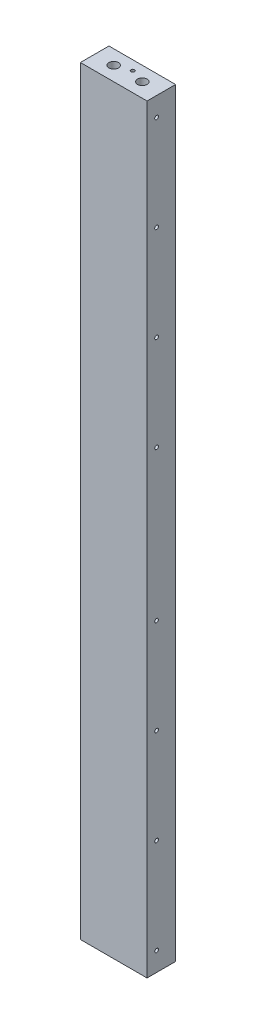
ISO-10303-21;
HEADER;
FILE_DESCRIPTION(('STEP AP214'),'2;1');
FILE_NAME('part.step','',(''),(''),'','','');
FILE_SCHEMA(('AUTOMOTIVE_DESIGN { 1 0 10303 214 1 1 1 1 }'));
ENDSEC;
DATA;
#1=APPLICATION_CONTEXT('core data for automotive mechanical design processes');
#2=APPLICATION_PROTOCOL_DEFINITION('international standard','automotive_design',2000,#1);
#3=PRODUCT_CONTEXT('',#1,'mechanical');
#4=PRODUCT('Part','Part','',(#3));
#5=PRODUCT_RELATED_PRODUCT_CATEGORY('part','',(#4));
#6=PRODUCT_DEFINITION_FORMATION('','',#4);
#7=PRODUCT_DEFINITION_CONTEXT('part definition',#1,'design');
#8=PRODUCT_DEFINITION('design','',#6,#7);
#9=PRODUCT_DEFINITION_SHAPE('','',#8);
#10=(LENGTH_UNIT() NAMED_UNIT(*) SI_UNIT(.MILLI.,.METRE.));
#11=(NAMED_UNIT(*) PLANE_ANGLE_UNIT() SI_UNIT($,.RADIAN.));
#12=(NAMED_UNIT(*) SI_UNIT($,.STERADIAN.) SOLID_ANGLE_UNIT());
#13=UNCERTAINTY_MEASURE_WITH_UNIT(LENGTH_MEASURE(1.E-05),#10,'distance_accuracy_value','');
#14=(GEOMETRIC_REPRESENTATION_CONTEXT(3) GLOBAL_UNCERTAINTY_ASSIGNED_CONTEXT((#13)) GLOBAL_UNIT_ASSIGNED_CONTEXT((#10,
#11,#12)) REPRESENTATION_CONTEXT('',''));
#15=CARTESIAN_POINT('',(0.,0.,0.));
#16=DIRECTION('',(0.,0.,1.));
#17=DIRECTION('',(1.,0.,0.));
#18=AXIS2_PLACEMENT_3D('',#15,#16,#17);
#19=CARTESIAN_POINT('',(0.,1012.825,0.));
#20=DIRECTION('',(1.,0.,0.));
#21=DIRECTION('',(0.,0.,-1.));
#22=AXIS2_PLACEMENT_3D('',#19,#20,#21);
#23=PLANE('',#22);
#24=DIRECTION('',(0.,0.,1.));
#25=VECTOR('',#24,1.);
#26=CARTESIAN_POINT('',(0.,0.,0.));
#27=LINE('',#26,#25);
#28=CARTESIAN_POINT('',(0.,0.,0.));
#29=VERTEX_POINT('',#28);
#30=CARTESIAN_POINT('',(0.,0.,38.1));
#31=VERTEX_POINT('',#30);
#32=EDGE_CURVE('E228',#29,#31,#27,.T.);
#33=ORIENTED_EDGE('',*,*,#32,.T.);
#34=DIRECTION('',(0.,-1.,0.));
#35=VECTOR('',#34,1.);
#36=CARTESIAN_POINT('',(0.,1012.825,38.1));
#37=LINE('',#36,#35);
#38=CARTESIAN_POINT('',(0.,1012.825,38.1));
#39=VERTEX_POINT('',#38);
#40=EDGE_CURVE('E12',#39,#31,#37,.T.);
#41=ORIENTED_EDGE('',*,*,#40,.F.);
#42=DIRECTION('',(0.,0.,1.));
#43=VECTOR('',#42,1.);
#44=CARTESIAN_POINT('',(0.,1012.825,0.));
#45=LINE('',#44,#43);
#46=CARTESIAN_POINT('',(0.,1012.825,0.));
#47=VERTEX_POINT('',#46);
#48=EDGE_CURVE('E239',#47,#39,#45,.T.);
#49=ORIENTED_EDGE('',*,*,#48,.F.);
#50=DIRECTION('',(0.,-1.,0.));
#51=VECTOR('',#50,1.);
#52=CARTESIAN_POINT('',(0.,1012.825,0.));
#53=LINE('',#52,#51);
#54=EDGE_CURVE('E245',#47,#29,#53,.T.);
#55=ORIENTED_EDGE('',*,*,#54,.T.);
#56=EDGE_LOOP('',(#33,#41,#49,#55));
#57=FACE_BOUND('',#56,.T.);
#58=ADVANCED_FACE('F56',(#57),#23,.F.);
#59=CARTESIAN_POINT('',(0.,1012.825,38.1));
#60=DIRECTION('',(0.,0.,-1.));
#61=DIRECTION('',(-1.,0.,0.));
#62=AXIS2_PLACEMENT_3D('',#59,#60,#61);
#63=PLANE('',#62);
#64=DIRECTION('',(1.,0.,0.));
#65=VECTOR('',#64,1.);
#66=CARTESIAN_POINT('',(0.,0.,38.1));
#67=LINE('',#66,#65);
#68=CARTESIAN_POINT('',(88.9,0.,38.1));
#69=VERTEX_POINT('',#68);
#70=EDGE_CURVE('E248',#31,#69,#67,.T.);
#71=ORIENTED_EDGE('',*,*,#70,.T.);
#72=DIRECTION('',(0.,-1.,0.));
#73=VECTOR('',#72,1.);
#74=CARTESIAN_POINT('',(88.9,1012.825,38.1));
#75=LINE('',#74,#73);
#76=CARTESIAN_POINT('',(88.9,1012.825,38.1));
#77=VERTEX_POINT('',#76);
#78=EDGE_CURVE('E64',#77,#69,#75,.T.);
#79=ORIENTED_EDGE('',*,*,#78,.F.);
#80=DIRECTION('',(1.,0.,0.));
#81=VECTOR('',#80,1.);
#82=CARTESIAN_POINT('',(0.,1012.825,38.1));
#83=LINE('',#82,#81);
#84=EDGE_CURVE('E103',#39,#77,#83,.T.);
#85=ORIENTED_EDGE('',*,*,#84,.F.);
#86=ORIENTED_EDGE('',*,*,#40,.T.);
#87=EDGE_LOOP('',(#71,#79,#85,#86));
#88=FACE_BOUND('',#87,.T.);
#89=ADVANCED_FACE('F274',(#88),#63,.F.);
#90=CARTESIAN_POINT('',(88.9,1012.825,0.));
#91=DIRECTION('',(-1.,0.,0.));
#92=DIRECTION('',(0.,0.,1.));
#93=AXIS2_PLACEMENT_3D('',#90,#91,#92);
#94=PLANE('',#93);
#95=CARTESIAN_POINT('',(88.9,987.425,25.4));
#96=DIRECTION('',(1.,0.,0.));
#97=DIRECTION('',(0.,0.,-1.));
#98=AXIS2_PLACEMENT_3D('',#95,#96,#97);
#99=CIRCLE('',#98,2.45744999999997);
#100=CARTESIAN_POINT('',(88.9,987.425,22.94255));
#101=VERTEX_POINT('',#100);
#102=EDGE_CURVE('E148',#101,#101,#99,.T.);
#103=ORIENTED_EDGE('',*,*,#102,.F.);
#104=EDGE_LOOP('',(#103));
#105=FACE_BOUND('',#104,.T.);
#106=CARTESIAN_POINT('',(88.9,860.425,25.4));
#107=DIRECTION('',(1.,0.,0.));
#108=DIRECTION('',(0.,0.,-1.));
#109=AXIS2_PLACEMENT_3D('',#106,#107,#108);
#110=CIRCLE('',#109,2.45744999999997);
#111=CARTESIAN_POINT('',(88.9,860.425,22.94255));
#112=VERTEX_POINT('',#111);
#113=EDGE_CURVE('E147',#112,#112,#110,.T.);
#114=ORIENTED_EDGE('',*,*,#113,.F.);
#115=EDGE_LOOP('',(#114));
#116=FACE_BOUND('',#115,.T.);
#117=CARTESIAN_POINT('',(88.9,733.425,25.4));
#118=DIRECTION('',(1.,0.,0.));
#119=DIRECTION('',(0.,0.,-1.));
#120=AXIS2_PLACEMENT_3D('',#117,#118,#119);
#121=CIRCLE('',#120,2.45744999999997);
#122=CARTESIAN_POINT('',(88.9,733.425,22.94255));
#123=VERTEX_POINT('',#122);
#124=EDGE_CURVE('E158',#123,#123,#121,.T.);
#125=ORIENTED_EDGE('',*,*,#124,.F.);
#126=EDGE_LOOP('',(#125));
#127=FACE_BOUND('',#126,.T.);
#128=CARTESIAN_POINT('',(88.9,606.425,25.4));
#129=DIRECTION('',(1.,0.,0.));
#130=DIRECTION('',(0.,0.,-1.));
#131=AXIS2_PLACEMENT_3D('',#128,#129,#130);
#132=CIRCLE('',#131,2.45744999999997);
#133=CARTESIAN_POINT('',(88.9,606.425,22.94255));
#134=VERTEX_POINT('',#133);
#135=EDGE_CURVE('E164',#134,#134,#132,.T.);
#136=ORIENTED_EDGE('',*,*,#135,.F.);
#137=EDGE_LOOP('',(#136));
#138=FACE_BOUND('',#137,.T.);
#139=CARTESIAN_POINT('',(88.9,406.4,25.4));
#140=DIRECTION('',(1.,0.,0.));
#141=DIRECTION('',(0.,0.,-1.));
#142=AXIS2_PLACEMENT_3D('',#139,#140,#141);
#143=CIRCLE('',#142,2.45744999999997);
#144=CARTESIAN_POINT('',(88.9,406.4,22.94255));
#145=VERTEX_POINT('',#144);
#146=EDGE_CURVE('E170',#145,#145,#143,.T.);
#147=ORIENTED_EDGE('',*,*,#146,.F.);
#148=EDGE_LOOP('',(#147));
#149=FACE_BOUND('',#148,.T.);
#150=CARTESIAN_POINT('',(88.9,279.4,25.4));
#151=DIRECTION('',(1.,0.,0.));
#152=DIRECTION('',(0.,0.,-1.));
#153=AXIS2_PLACEMENT_3D('',#150,#151,#152);
#154=CIRCLE('',#153,2.45744999999997);
#155=CARTESIAN_POINT('',(88.9,279.4,22.94255));
#156=VERTEX_POINT('',#155);
#157=EDGE_CURVE('E176',#156,#156,#154,.T.);
#158=ORIENTED_EDGE('',*,*,#157,.F.);
#159=EDGE_LOOP('',(#158));
#160=FACE_BOUND('',#159,.T.);
#161=CARTESIAN_POINT('',(88.9,152.4,25.4));
#162=DIRECTION('',(1.,0.,0.));
#163=DIRECTION('',(0.,0.,-1.));
#164=AXIS2_PLACEMENT_3D('',#161,#162,#163);
#165=CIRCLE('',#164,2.45745);
#166=CARTESIAN_POINT('',(88.9,152.4,22.94255));
#167=VERTEX_POINT('',#166);
#168=EDGE_CURVE('E182',#167,#167,#165,.T.);
#169=ORIENTED_EDGE('',*,*,#168,.F.);
#170=EDGE_LOOP('',(#169));
#171=FACE_BOUND('',#170,.T.);
#172=CARTESIAN_POINT('',(88.9,25.4,25.4));
#173=DIRECTION('',(1.,0.,0.));
#174=DIRECTION('',(0.,0.,-1.));
#175=AXIS2_PLACEMENT_3D('',#172,#173,#174);
#176=CIRCLE('',#175,2.45744999999999);
#177=CARTESIAN_POINT('',(88.9,25.4,22.94255));
#178=VERTEX_POINT('',#177);
#179=EDGE_CURVE('E188',#178,#178,#176,.T.);
#180=ORIENTED_EDGE('',*,*,#179,.F.);
#181=EDGE_LOOP('',(#180));
#182=FACE_BOUND('',#181,.T.);
#183=DIRECTION('',(0.,0.,-1.));
#184=VECTOR('',#183,1.);
#185=CARTESIAN_POINT('',(88.9,0.,0.));
#186=LINE('',#185,#184);
#187=CARTESIAN_POINT('',(88.9,0.,0.));
#188=VERTEX_POINT('',#187);
#189=EDGE_CURVE('E90',#69,#188,#186,.T.);
#190=ORIENTED_EDGE('',*,*,#189,.T.);
#191=DIRECTION('',(0.,-1.,0.));
#192=VECTOR('',#191,1.);
#193=CARTESIAN_POINT('',(88.9,1012.825,0.));
#194=LINE('',#193,#192);
#195=CARTESIAN_POINT('',(88.9,1012.825,0.));
#196=VERTEX_POINT('',#195);
#197=EDGE_CURVE('E253',#196,#188,#194,.T.);
#198=ORIENTED_EDGE('',*,*,#197,.F.);
#199=DIRECTION('',(0.,0.,-1.));
#200=VECTOR('',#199,1.);
#201=CARTESIAN_POINT('',(88.9,1012.825,0.));
#202=LINE('',#201,#200);
#203=EDGE_CURVE('E242',#77,#196,#202,.T.);
#204=ORIENTED_EDGE('',*,*,#203,.F.);
#205=ORIENTED_EDGE('',*,*,#78,.T.);
#206=EDGE_LOOP('',(#190,#198,#204,#205));
#207=FACE_BOUND('',#206,.T.);
#208=ADVANCED_FACE('F255',(#105,#116,#127,#138,#149,#160,#171,#182,#207),#94,.F.);
#209=CARTESIAN_POINT('',(0.,1012.825,0.));
#210=DIRECTION('',(0.,0.,1.));
#211=DIRECTION('',(1.,0.,0.));
#212=AXIS2_PLACEMENT_3D('',#209,#210,#211);
#213=PLANE('',#212);
#214=DIRECTION('',(-1.,0.,0.));
#215=VECTOR('',#214,1.);
#216=CARTESIAN_POINT('',(0.,0.,0.));
#217=LINE('',#216,#215);
#218=EDGE_CURVE('E96',#188,#29,#217,.T.);
#219=ORIENTED_EDGE('',*,*,#218,.T.);
#220=ORIENTED_EDGE('',*,*,#54,.F.);
#221=DIRECTION('',(-1.,0.,0.));
#222=VECTOR('',#221,1.);
#223=CARTESIAN_POINT('',(0.,1012.825,0.));
#224=LINE('',#223,#222);
#225=EDGE_CURVE('E72',#196,#47,#224,.T.);
#226=ORIENTED_EDGE('',*,*,#225,.F.);
#227=ORIENTED_EDGE('',*,*,#197,.T.);
#228=EDGE_LOOP('',(#219,#220,#226,#227));
#229=FACE_BOUND('',#228,.T.);
#230=ADVANCED_FACE('F262',(#229),#213,.F.);
#231=CARTESIAN_POINT('',(0.,1012.825,0.));
#232=DIRECTION('',(0.,1.,0.));
#233=DIRECTION('',(0.,0.,1.));
#234=AXIS2_PLACEMENT_3D('',#231,#232,#233);
#235=PLANE('',#234);
#236=CARTESIAN_POINT('',(44.45,1012.825,12.7));
#237=DIRECTION('',(0.,1.,0.));
#238=DIRECTION('',(0.,0.,1.));
#239=AXIS2_PLACEMENT_3D('',#236,#237,#238);
#240=CIRCLE('',#239,2.45744999999999);
#241=CARTESIAN_POINT('',(44.45,1012.825,15.15745));
#242=VERTEX_POINT('',#241);
#243=EDGE_CURVE('E193',#242,#242,#240,.T.);
#244=ORIENTED_EDGE('',*,*,#243,.F.);
#245=EDGE_LOOP('',(#244));
#246=FACE_BOUND('',#245,.T.);
#247=CARTESIAN_POINT('',(25.4,1012.825,19.05));
#248=DIRECTION('',(0.,1.,0.));
#249=DIRECTION('',(0.,0.,1.));
#250=AXIS2_PLACEMENT_3D('',#247,#248,#249);
#251=CIRCLE('',#250,6.35000000000001);
#252=CARTESIAN_POINT('',(25.4,1012.825,25.4));
#253=VERTEX_POINT('',#252);
#254=EDGE_CURVE('E229',#253,#253,#251,.T.);
#255=ORIENTED_EDGE('',*,*,#254,.F.);
#256=EDGE_LOOP('',(#255));
#257=FACE_BOUND('',#256,.T.);
#258=CARTESIAN_POINT('',(63.5,1012.825,19.05));
#259=DIRECTION('',(0.,1.,0.));
#260=DIRECTION('',(0.,0.,1.));
#261=AXIS2_PLACEMENT_3D('',#258,#259,#260);
#262=CIRCLE('',#261,6.35);
#263=CARTESIAN_POINT('',(63.5,1012.825,25.4));
#264=VERTEX_POINT('',#263);
#265=EDGE_CURVE('E232',#264,#264,#262,.T.);
#266=ORIENTED_EDGE('',*,*,#265,.F.);
#267=EDGE_LOOP('',(#266));
#268=FACE_BOUND('',#267,.T.);
#269=ORIENTED_EDGE('',*,*,#48,.T.);
#270=ORIENTED_EDGE('',*,*,#84,.T.);
#271=ORIENTED_EDGE('',*,*,#203,.T.);
#272=ORIENTED_EDGE('',*,*,#225,.T.);
#273=EDGE_LOOP('',(#269,#270,#271,#272));
#274=FACE_BOUND('',#273,.T.);
#275=ADVANCED_FACE('F264',(#246,#257,#268,#274),#235,.T.);
#276=CARTESIAN_POINT('',(0.,0.,0.));
#277=DIRECTION('',(0.,1.,0.));
#278=DIRECTION('',(0.,0.,1.));
#279=AXIS2_PLACEMENT_3D('',#276,#277,#278);
#280=PLANE('',#279);
#281=CARTESIAN_POINT('',(12.7,0.,19.05));
#282=DIRECTION('',(0.,-1.,0.));
#283=DIRECTION('',(0.,0.,-1.));
#284=AXIS2_PLACEMENT_3D('',#281,#282,#283);
#285=CIRCLE('',#284,2.45744999999999);
#286=CARTESIAN_POINT('',(12.7,0.,16.59255));
#287=VERTEX_POINT('',#286);
#288=EDGE_CURVE('E200',#287,#287,#285,.T.);
#289=ORIENTED_EDGE('',*,*,#288,.F.);
#290=EDGE_LOOP('',(#289));
#291=FACE_BOUND('',#290,.T.);
#292=CARTESIAN_POINT('',(76.2,0.,12.7));
#293=DIRECTION('',(0.,-1.,0.));
#294=DIRECTION('',(0.,0.,-1.));
#295=AXIS2_PLACEMENT_3D('',#292,#293,#294);
#296=CIRCLE('',#295,2.45744999999999);
#297=CARTESIAN_POINT('',(76.2,0.,10.24255));
#298=VERTEX_POINT('',#297);
#299=EDGE_CURVE('E206',#298,#298,#296,.T.);
#300=ORIENTED_EDGE('',*,*,#299,.F.);
#301=EDGE_LOOP('',(#300));
#302=FACE_BOUND('',#301,.T.);
#303=CARTESIAN_POINT('',(25.4,0.,19.05));
#304=DIRECTION('',(0.,-1.,0.));
#305=DIRECTION('',(0.,0.,-1.));
#306=AXIS2_PLACEMENT_3D('',#303,#304,#305);
#307=CIRCLE('',#306,6.35000000000001);
#308=CARTESIAN_POINT('',(25.4,0.,12.7));
#309=VERTEX_POINT('',#308);
#310=EDGE_CURVE('E221',#309,#309,#307,.T.);
#311=ORIENTED_EDGE('',*,*,#310,.F.);
#312=EDGE_LOOP('',(#311));
#313=FACE_BOUND('',#312,.T.);
#314=CARTESIAN_POINT('',(63.5,0.,19.05));
#315=DIRECTION('',(0.,-1.,0.));
#316=DIRECTION('',(0.,0.,-1.));
#317=AXIS2_PLACEMENT_3D('',#314,#315,#316);
#318=CIRCLE('',#317,6.35);
#319=CARTESIAN_POINT('',(63.5,0.,12.7));
#320=VERTEX_POINT('',#319);
#321=EDGE_CURVE('E216',#320,#320,#318,.T.);
#322=ORIENTED_EDGE('',*,*,#321,.F.);
#323=EDGE_LOOP('',(#322));
#324=FACE_BOUND('',#323,.T.);
#325=ORIENTED_EDGE('',*,*,#32,.F.);
#326=ORIENTED_EDGE('',*,*,#218,.F.);
#327=ORIENTED_EDGE('',*,*,#189,.F.);
#328=ORIENTED_EDGE('',*,*,#70,.F.);
#329=EDGE_LOOP('',(#325,#326,#327,#328));
#330=FACE_BOUND('',#329,.T.);
#331=ADVANCED_FACE('F258',(#291,#302,#313,#324,#330),#280,.F.);
#332=CARTESIAN_POINT('',(63.5,993.775,19.05));
#333=DIRECTION('',(0.,1.,0.));
#334=DIRECTION('',(0.,0.,1.));
#335=AXIS2_PLACEMENT_3D('',#332,#333,#334);
#336=CYLINDRICAL_SURFACE('',#335,6.35);
#337=CARTESIAN_POINT('',(63.5,993.775,19.05));
#338=DIRECTION('',(0.,1.,0.));
#339=DIRECTION('',(0.,0.,1.));
#340=AXIS2_PLACEMENT_3D('',#337,#338,#339);
#341=CIRCLE('',#340,6.35);
#342=CARTESIAN_POINT('',(63.5,993.775,25.4));
#343=VERTEX_POINT('',#342);
#344=EDGE_CURVE('E235',#343,#343,#341,.T.);
#345=ORIENTED_EDGE('',*,*,#344,.F.);
#346=EDGE_LOOP('',(#345));
#347=FACE_BOUND('',#346,.T.);
#348=ORIENTED_EDGE('',*,*,#265,.T.);
#349=EDGE_LOOP('',(#348));
#350=FACE_BOUND('',#349,.T.);
#351=ADVANCED_FACE('F315',(#347,#350),#336,.F.);
#352=CARTESIAN_POINT('',(63.5,993.775,19.05));
#353=DIRECTION('',(0.,1.,0.));
#354=DIRECTION('',(0.,0.,1.));
#355=AXIS2_PLACEMENT_3D('',#352,#353,#354);
#356=PLANE('',#355);
#357=ORIENTED_EDGE('',*,*,#344,.T.);
#358=EDGE_LOOP('',(#357));
#359=FACE_BOUND('',#358,.T.);
#360=ADVANCED_FACE('F324',(#359),#356,.T.);
#361=CARTESIAN_POINT('',(25.4,993.775,19.05));
#362=DIRECTION('',(0.,1.,0.));
#363=DIRECTION('',(0.,0.,1.));
#364=AXIS2_PLACEMENT_3D('',#361,#362,#363);
#365=CYLINDRICAL_SURFACE('',#364,6.35000000000001);
#366=CARTESIAN_POINT('',(25.4,993.775,19.05));
#367=DIRECTION('',(0.,1.,0.));
#368=DIRECTION('',(0.,0.,1.));
#369=AXIS2_PLACEMENT_3D('',#366,#367,#368);
#370=CIRCLE('',#369,6.35000000000001);
#371=CARTESIAN_POINT('',(25.4,993.775,25.4));
#372=VERTEX_POINT('',#371);
#373=EDGE_CURVE('E225',#372,#372,#370,.T.);
#374=ORIENTED_EDGE('',*,*,#373,.F.);
#375=EDGE_LOOP('',(#374));
#376=FACE_BOUND('',#375,.T.);
#377=ORIENTED_EDGE('',*,*,#254,.T.);
#378=EDGE_LOOP('',(#377));
#379=FACE_BOUND('',#378,.T.);
#380=ADVANCED_FACE('F334',(#376,#379),#365,.F.);
#381=CARTESIAN_POINT('',(25.4,993.775,19.05));
#382=DIRECTION('',(0.,1.,0.));
#383=DIRECTION('',(0.,0.,1.));
#384=AXIS2_PLACEMENT_3D('',#381,#382,#383);
#385=PLANE('',#384);
#386=ORIENTED_EDGE('',*,*,#373,.T.);
#387=EDGE_LOOP('',(#386));
#388=FACE_BOUND('',#387,.T.);
#389=ADVANCED_FACE('F344',(#388),#385,.T.);
#390=CARTESIAN_POINT('',(63.5,19.05,19.05));
#391=DIRECTION('',(0.,-1.,0.));
#392=DIRECTION('',(0.,0.,-1.));
#393=AXIS2_PLACEMENT_3D('',#390,#391,#392);
#394=CYLINDRICAL_SURFACE('',#393,6.35);
#395=CARTESIAN_POINT('',(63.5,19.05,19.05));
#396=DIRECTION('',(0.,-1.,0.));
#397=DIRECTION('',(0.,0.,-1.));
#398=AXIS2_PLACEMENT_3D('',#395,#396,#397);
#399=CIRCLE('',#398,6.35);
#400=CARTESIAN_POINT('',(63.5,19.05,12.7));
#401=VERTEX_POINT('',#400);
#402=EDGE_CURVE('E222',#401,#401,#399,.T.);
#403=ORIENTED_EDGE('',*,*,#402,.F.);
#404=EDGE_LOOP('',(#403));
#405=FACE_BOUND('',#404,.T.);
#406=ORIENTED_EDGE('',*,*,#321,.T.);
#407=EDGE_LOOP('',(#406));
#408=FACE_BOUND('',#407,.T.);
#409=ADVANCED_FACE('F354',(#405,#408),#394,.F.);
#410=CARTESIAN_POINT('',(63.5,19.05,19.05));
#411=DIRECTION('',(0.,-1.,0.));
#412=DIRECTION('',(0.,0.,-1.));
#413=AXIS2_PLACEMENT_3D('',#410,#411,#412);
#414=PLANE('',#413);
#415=ORIENTED_EDGE('',*,*,#402,.T.);
#416=EDGE_LOOP('',(#415));
#417=FACE_BOUND('',#416,.T.);
#418=ADVANCED_FACE('F364',(#417),#414,.T.);
#419=CARTESIAN_POINT('',(25.4,19.05,19.05));
#420=DIRECTION('',(0.,-1.,0.));
#421=DIRECTION('',(0.,0.,-1.));
#422=AXIS2_PLACEMENT_3D('',#419,#420,#421);
#423=CYLINDRICAL_SURFACE('',#422,6.35000000000001);
#424=CARTESIAN_POINT('',(25.4,19.05,19.05));
#425=DIRECTION('',(0.,-1.,0.));
#426=DIRECTION('',(0.,0.,-1.));
#427=AXIS2_PLACEMENT_3D('',#424,#425,#426);
#428=CIRCLE('',#427,6.35000000000001);
#429=CARTESIAN_POINT('',(25.4,19.05,12.7));
#430=VERTEX_POINT('',#429);
#431=EDGE_CURVE('E238',#430,#430,#428,.T.);
#432=ORIENTED_EDGE('',*,*,#431,.F.);
#433=EDGE_LOOP('',(#432));
#434=FACE_BOUND('',#433,.T.);
#435=ORIENTED_EDGE('',*,*,#310,.T.);
#436=EDGE_LOOP('',(#435));
#437=FACE_BOUND('',#436,.T.);
#438=ADVANCED_FACE('F374',(#434,#437),#423,.F.);
#439=CARTESIAN_POINT('',(25.4,19.05,19.05));
#440=DIRECTION('',(0.,-1.,0.));
#441=DIRECTION('',(0.,0.,-1.));
#442=AXIS2_PLACEMENT_3D('',#439,#440,#441);
#443=PLANE('',#442);
#444=ORIENTED_EDGE('',*,*,#431,.T.);
#445=EDGE_LOOP('',(#444));
#446=FACE_BOUND('',#445,.T.);
#447=ADVANCED_FACE('F384',(#446),#443,.T.);
#448=CARTESIAN_POINT('',(76.2,76.2,12.7));
#449=DIRECTION('',(0.,-1.,0.));
#450=DIRECTION('',(0.,0.,-1.));
#451=AXIS2_PLACEMENT_3D('',#448,#449,#450);
#452=CONICAL_SURFACE('',#451,2.45744999999999,1.02974425867665);
#453=CARTESIAN_POINT('',(76.2,77.6765849282293,12.7));
#454=VERTEX_POINT('',#453);
#455=VERTEX_LOOP('',#454);
#456=FACE_BOUND('',#455,.T.);
#457=CARTESIAN_POINT('',(76.2,76.2,12.7));
#458=DIRECTION('',(0.,-1.,0.));
#459=DIRECTION('',(0.,0.,-1.));
#460=AXIS2_PLACEMENT_3D('',#457,#458,#459);
#461=CIRCLE('',#460,2.45744999999999);
#462=CARTESIAN_POINT('',(76.2,76.2,10.24255));
#463=VERTEX_POINT('',#462);
#464=EDGE_CURVE('E210',#463,#463,#461,.T.);
#465=ORIENTED_EDGE('',*,*,#464,.T.);
#466=EDGE_LOOP('',(#465));
#467=FACE_BOUND('',#466,.T.);
#468=ADVANCED_FACE('F393',(#456,#467),#452,.F.);
#469=CARTESIAN_POINT('',(76.2,0.,12.7));
#470=DIRECTION('',(0.,-1.,0.));
#471=DIRECTION('',(0.,0.,-1.));
#472=AXIS2_PLACEMENT_3D('',#469,#470,#471);
#473=CYLINDRICAL_SURFACE('',#472,2.45744999999999);
#474=ORIENTED_EDGE('',*,*,#464,.F.);
#475=EDGE_LOOP('',(#474));
#476=FACE_BOUND('',#475,.T.);
#477=ORIENTED_EDGE('',*,*,#299,.T.);
#478=EDGE_LOOP('',(#477));
#479=FACE_BOUND('',#478,.T.);
#480=ADVANCED_FACE('F402',(#476,#479),#473,.F.);
#481=CARTESIAN_POINT('',(12.7,76.2,19.05));
#482=DIRECTION('',(0.,-1.,0.));
#483=DIRECTION('',(0.,0.,-1.));
#484=AXIS2_PLACEMENT_3D('',#481,#482,#483);
#485=CONICAL_SURFACE('',#484,2.45744999999999,1.02974425867665);
#486=CARTESIAN_POINT('',(12.7,77.6765849282293,19.05));
#487=VERTEX_POINT('',#486);
#488=VERTEX_LOOP('',#487);
#489=FACE_BOUND('',#488,.T.);
#490=CARTESIAN_POINT('',(12.7,76.2,19.05));
#491=DIRECTION('',(0.,-1.,0.));
#492=DIRECTION('',(0.,0.,-1.));
#493=AXIS2_PLACEMENT_3D('',#490,#491,#492);
#494=CIRCLE('',#493,2.45744999999999);
#495=CARTESIAN_POINT('',(12.7,76.2,16.59255));
#496=VERTEX_POINT('',#495);
#497=EDGE_CURVE('E203',#496,#496,#494,.T.);
#498=ORIENTED_EDGE('',*,*,#497,.T.);
#499=EDGE_LOOP('',(#498));
#500=FACE_BOUND('',#499,.T.);
#501=ADVANCED_FACE('F412',(#489,#500),#485,.F.);
#502=CARTESIAN_POINT('',(12.7,0.,19.05));
#503=DIRECTION('',(0.,-1.,0.));
#504=DIRECTION('',(0.,0.,-1.));
#505=AXIS2_PLACEMENT_3D('',#502,#503,#504);
#506=CYLINDRICAL_SURFACE('',#505,2.45744999999999);
#507=ORIENTED_EDGE('',*,*,#497,.F.);
#508=EDGE_LOOP('',(#507));
#509=FACE_BOUND('',#508,.T.);
#510=ORIENTED_EDGE('',*,*,#288,.T.);
#511=EDGE_LOOP('',(#510));
#512=FACE_BOUND('',#511,.T.);
#513=ADVANCED_FACE('F422',(#509,#512),#506,.F.);
#514=CARTESIAN_POINT('',(44.45,936.625,12.7));
#515=DIRECTION('',(0.,1.,0.));
#516=DIRECTION('',(0.,0.,1.));
#517=AXIS2_PLACEMENT_3D('',#514,#515,#516);
#518=CONICAL_SURFACE('',#517,2.45744999999999,1.02974425867667);
#519=CARTESIAN_POINT('',(44.45,935.148415071771,12.7));
#520=VERTEX_POINT('',#519);
#521=VERTEX_LOOP('',#520);
#522=FACE_BOUND('',#521,.T.);
#523=CARTESIAN_POINT('',(44.45,936.625,12.7));
#524=DIRECTION('',(0.,1.,0.));
#525=DIRECTION('',(0.,0.,1.));
#526=AXIS2_PLACEMENT_3D('',#523,#524,#525);
#527=CIRCLE('',#526,2.45744999999999);
#528=CARTESIAN_POINT('',(44.45,936.625,15.15745));
#529=VERTEX_POINT('',#528);
#530=EDGE_CURVE('E197',#529,#529,#527,.T.);
#531=ORIENTED_EDGE('',*,*,#530,.T.);
#532=EDGE_LOOP('',(#531));
#533=FACE_BOUND('',#532,.T.);
#534=ADVANCED_FACE('F432',(#522,#533),#518,.F.);
#535=CARTESIAN_POINT('',(44.45,1012.825,12.7));
#536=DIRECTION('',(0.,1.,0.));
#537=DIRECTION('',(0.,0.,1.));
#538=AXIS2_PLACEMENT_3D('',#535,#536,#537);
#539=CYLINDRICAL_SURFACE('',#538,2.45744999999999);
#540=ORIENTED_EDGE('',*,*,#530,.F.);
#541=EDGE_LOOP('',(#540));
#542=FACE_BOUND('',#541,.T.);
#543=ORIENTED_EDGE('',*,*,#243,.T.);
#544=EDGE_LOOP('',(#543));
#545=FACE_BOUND('',#544,.T.);
#546=ADVANCED_FACE('F442',(#542,#545),#539,.F.);
#547=CARTESIAN_POINT('',(38.1,25.4,25.4));
#548=DIRECTION('',(1.,0.,0.));
#549=DIRECTION('',(0.,0.,-1.));
#550=AXIS2_PLACEMENT_3D('',#547,#548,#549);
#551=CONICAL_SURFACE('',#550,2.45744999999998,1.02974425867665);
#552=CARTESIAN_POINT('',(36.6234150717707,25.4,25.4));
#553=VERTEX_POINT('',#552);
#554=VERTEX_LOOP('',#553);
#555=FACE_BOUND('',#554,.T.);
#556=CARTESIAN_POINT('',(38.1,25.4,25.4));
#557=DIRECTION('',(1.,0.,0.));
#558=DIRECTION('',(0.,0.,-1.));
#559=AXIS2_PLACEMENT_3D('',#556,#557,#558);
#560=CIRCLE('',#559,2.45744999999998);
#561=CARTESIAN_POINT('',(38.1,25.4,22.94255));
#562=VERTEX_POINT('',#561);
#563=EDGE_CURVE('E191',#562,#562,#560,.T.);
#564=ORIENTED_EDGE('',*,*,#563,.T.);
#565=EDGE_LOOP('',(#564));
#566=FACE_BOUND('',#565,.T.);
#567=ADVANCED_FACE('F451',(#555,#566),#551,.F.);
#568=CARTESIAN_POINT('',(88.9,25.4,25.4));
#569=DIRECTION('',(1.,0.,0.));
#570=DIRECTION('',(0.,0.,-1.));
#571=AXIS2_PLACEMENT_3D('',#568,#569,#570);
#572=CYLINDRICAL_SURFACE('',#571,2.45744999999999);
#573=ORIENTED_EDGE('',*,*,#563,.F.);
#574=EDGE_LOOP('',(#573));
#575=FACE_BOUND('',#574,.T.);
#576=ORIENTED_EDGE('',*,*,#179,.T.);
#577=EDGE_LOOP('',(#576));
#578=FACE_BOUND('',#577,.T.);
#579=ADVANCED_FACE('F460',(#575,#578),#572,.F.);
#580=CARTESIAN_POINT('',(38.1,152.4,25.4));
#581=DIRECTION('',(1.,0.,0.));
#582=DIRECTION('',(0.,0.,-1.));
#583=AXIS2_PLACEMENT_3D('',#580,#581,#582);
#584=CONICAL_SURFACE('',#583,2.45744999999997,1.02974425867665);
#585=CARTESIAN_POINT('',(36.6234150717707,152.4,25.4));
#586=VERTEX_POINT('',#585);
#587=VERTEX_LOOP('',#586);
#588=FACE_BOUND('',#587,.T.);
#589=CARTESIAN_POINT('',(38.1,152.4,25.4));
#590=DIRECTION('',(1.,0.,0.));
#591=DIRECTION('',(0.,0.,-1.));
#592=AXIS2_PLACEMENT_3D('',#589,#590,#591);
#593=CIRCLE('',#592,2.45744999999997);
#594=CARTESIAN_POINT('',(38.1,152.4,22.94255));
#595=VERTEX_POINT('',#594);
#596=EDGE_CURVE('E185',#595,#595,#593,.T.);
#597=ORIENTED_EDGE('',*,*,#596,.T.);
#598=EDGE_LOOP('',(#597));
#599=FACE_BOUND('',#598,.T.);
#600=ADVANCED_FACE('F470',(#588,#599),#584,.F.);
#601=CARTESIAN_POINT('',(88.9,152.4,25.4));
#602=DIRECTION('',(1.,0.,0.));
#603=DIRECTION('',(0.,0.,-1.));
#604=AXIS2_PLACEMENT_3D('',#601,#602,#603);
#605=CYLINDRICAL_SURFACE('',#604,2.45744999999999);
#606=ORIENTED_EDGE('',*,*,#596,.F.);
#607=EDGE_LOOP('',(#606));
#608=FACE_BOUND('',#607,.T.);
#609=ORIENTED_EDGE('',*,*,#168,.T.);
#610=EDGE_LOOP('',(#609));
#611=FACE_BOUND('',#610,.T.);
#612=ADVANCED_FACE('F480',(#608,#611),#605,.F.);
#613=CARTESIAN_POINT('',(38.1,279.4,25.4));
#614=DIRECTION('',(1.,0.,0.));
#615=DIRECTION('',(0.,0.,-1.));
#616=AXIS2_PLACEMENT_3D('',#613,#614,#615);
#617=CONICAL_SURFACE('',#616,2.45744999999997,1.02974425867665);
#618=CARTESIAN_POINT('',(36.6234150717707,279.4,25.4));
#619=VERTEX_POINT('',#618);
#620=VERTEX_LOOP('',#619);
#621=FACE_BOUND('',#620,.T.);
#622=CARTESIAN_POINT('',(38.1,279.4,25.4));
#623=DIRECTION('',(1.,0.,0.));
#624=DIRECTION('',(0.,0.,-1.));
#625=AXIS2_PLACEMENT_3D('',#622,#623,#624);
#626=CIRCLE('',#625,2.45744999999997);
#627=CARTESIAN_POINT('',(38.1,279.4,22.94255));
#628=VERTEX_POINT('',#627);
#629=EDGE_CURVE('E179',#628,#628,#626,.T.);
#630=ORIENTED_EDGE('',*,*,#629,.T.);
#631=EDGE_LOOP('',(#630));
#632=FACE_BOUND('',#631,.T.);
#633=ADVANCED_FACE('F490',(#621,#632),#617,.F.);
#634=CARTESIAN_POINT('',(88.9,279.4,25.4));
#635=DIRECTION('',(1.,0.,0.));
#636=DIRECTION('',(0.,0.,-1.));
#637=AXIS2_PLACEMENT_3D('',#634,#635,#636);
#638=CYLINDRICAL_SURFACE('',#637,2.45744999999997);
#639=ORIENTED_EDGE('',*,*,#629,.F.);
#640=EDGE_LOOP('',(#639));
#641=FACE_BOUND('',#640,.T.);
#642=ORIENTED_EDGE('',*,*,#157,.T.);
#643=EDGE_LOOP('',(#642));
#644=FACE_BOUND('',#643,.T.);
#645=ADVANCED_FACE('F500',(#641,#644),#638,.F.);
#646=CARTESIAN_POINT('',(38.1,406.4,25.4));
#647=DIRECTION('',(1.,0.,0.));
#648=DIRECTION('',(0.,0.,-1.));
#649=AXIS2_PLACEMENT_3D('',#646,#647,#648);
#650=CONICAL_SURFACE('',#649,2.45744999999997,1.02974425867665);
#651=CARTESIAN_POINT('',(36.6234150717707,406.4,25.4));
#652=VERTEX_POINT('',#651);
#653=VERTEX_LOOP('',#652);
#654=FACE_BOUND('',#653,.T.);
#655=CARTESIAN_POINT('',(38.1,406.4,25.4));
#656=DIRECTION('',(1.,0.,0.));
#657=DIRECTION('',(0.,0.,-1.));
#658=AXIS2_PLACEMENT_3D('',#655,#656,#657);
#659=CIRCLE('',#658,2.45744999999997);
#660=CARTESIAN_POINT('',(38.1,406.4,22.94255));
#661=VERTEX_POINT('',#660);
#662=EDGE_CURVE('E173',#661,#661,#659,.T.);
#663=ORIENTED_EDGE('',*,*,#662,.T.);
#664=EDGE_LOOP('',(#663));
#665=FACE_BOUND('',#664,.T.);
#666=ADVANCED_FACE('F510',(#654,#665),#650,.F.);
#667=CARTESIAN_POINT('',(88.9,406.4,25.4));
#668=DIRECTION('',(1.,0.,0.));
#669=DIRECTION('',(0.,0.,-1.));
#670=AXIS2_PLACEMENT_3D('',#667,#668,#669);
#671=CYLINDRICAL_SURFACE('',#670,2.45744999999997);
#672=ORIENTED_EDGE('',*,*,#662,.F.);
#673=EDGE_LOOP('',(#672));
#674=FACE_BOUND('',#673,.T.);
#675=ORIENTED_EDGE('',*,*,#146,.T.);
#676=EDGE_LOOP('',(#675));
#677=FACE_BOUND('',#676,.T.);
#678=ADVANCED_FACE('F520',(#674,#677),#671,.F.);
#679=CARTESIAN_POINT('',(38.1,606.425,25.4));
#680=DIRECTION('',(1.,0.,0.));
#681=DIRECTION('',(0.,0.,-1.));
#682=AXIS2_PLACEMENT_3D('',#679,#680,#681);
#683=CONICAL_SURFACE('',#682,2.45744999999997,1.02974425867665);
#684=CARTESIAN_POINT('',(36.6234150717707,606.425,25.4));
#685=VERTEX_POINT('',#684);
#686=VERTEX_LOOP('',#685);
#687=FACE_BOUND('',#686,.T.);
#688=CARTESIAN_POINT('',(38.1,606.425,25.4));
#689=DIRECTION('',(1.,0.,0.));
#690=DIRECTION('',(0.,0.,-1.));
#691=AXIS2_PLACEMENT_3D('',#688,#689,#690);
#692=CIRCLE('',#691,2.45744999999997);
#693=CARTESIAN_POINT('',(38.1,606.425,22.94255));
#694=VERTEX_POINT('',#693);
#695=EDGE_CURVE('E167',#694,#694,#692,.T.);
#696=ORIENTED_EDGE('',*,*,#695,.T.);
#697=EDGE_LOOP('',(#696));
#698=FACE_BOUND('',#697,.T.);
#699=ADVANCED_FACE('F530',(#687,#698),#683,.F.);
#700=CARTESIAN_POINT('',(88.9,606.425,25.4));
#701=DIRECTION('',(1.,0.,0.));
#702=DIRECTION('',(0.,0.,-1.));
#703=AXIS2_PLACEMENT_3D('',#700,#701,#702);
#704=CYLINDRICAL_SURFACE('',#703,2.45744999999997);
#705=ORIENTED_EDGE('',*,*,#695,.F.);
#706=EDGE_LOOP('',(#705));
#707=FACE_BOUND('',#706,.T.);
#708=ORIENTED_EDGE('',*,*,#135,.T.);
#709=EDGE_LOOP('',(#708));
#710=FACE_BOUND('',#709,.T.);
#711=ADVANCED_FACE('F540',(#707,#710),#704,.F.);
#712=CARTESIAN_POINT('',(38.1,733.425,25.4));
#713=DIRECTION('',(1.,0.,0.));
#714=DIRECTION('',(0.,0.,-1.));
#715=AXIS2_PLACEMENT_3D('',#712,#713,#714);
#716=CONICAL_SURFACE('',#715,2.45744999999997,1.02974425867665);
#717=CARTESIAN_POINT('',(36.6234150717707,733.425,25.4));
#718=VERTEX_POINT('',#717);
#719=VERTEX_LOOP('',#718);
#720=FACE_BOUND('',#719,.T.);
#721=CARTESIAN_POINT('',(38.1,733.425,25.4));
#722=DIRECTION('',(1.,0.,0.));
#723=DIRECTION('',(0.,0.,-1.));
#724=AXIS2_PLACEMENT_3D('',#721,#722,#723);
#725=CIRCLE('',#724,2.45744999999997);
#726=CARTESIAN_POINT('',(38.1,733.425,22.94255));
#727=VERTEX_POINT('',#726);
#728=EDGE_CURVE('E161',#727,#727,#725,.T.);
#729=ORIENTED_EDGE('',*,*,#728,.T.);
#730=EDGE_LOOP('',(#729));
#731=FACE_BOUND('',#730,.T.);
#732=ADVANCED_FACE('F550',(#720,#731),#716,.F.);
#733=CARTESIAN_POINT('',(88.9,733.425,25.4));
#734=DIRECTION('',(1.,0.,0.));
#735=DIRECTION('',(0.,0.,-1.));
#736=AXIS2_PLACEMENT_3D('',#733,#734,#735);
#737=CYLINDRICAL_SURFACE('',#736,2.45744999999997);
#738=ORIENTED_EDGE('',*,*,#728,.F.);
#739=EDGE_LOOP('',(#738));
#740=FACE_BOUND('',#739,.T.);
#741=ORIENTED_EDGE('',*,*,#124,.T.);
#742=EDGE_LOOP('',(#741));
#743=FACE_BOUND('',#742,.T.);
#744=ADVANCED_FACE('F560',(#740,#743),#737,.F.);
#745=CARTESIAN_POINT('',(38.1,860.425,25.4));
#746=DIRECTION('',(1.,0.,0.));
#747=DIRECTION('',(0.,0.,-1.));
#748=AXIS2_PLACEMENT_3D('',#745,#746,#747);
#749=CONICAL_SURFACE('',#748,2.45744999999997,1.02974425867665);
#750=CARTESIAN_POINT('',(36.6234150717707,860.425,25.4));
#751=VERTEX_POINT('',#750);
#752=VERTEX_LOOP('',#751);
#753=FACE_BOUND('',#752,.T.);
#754=CARTESIAN_POINT('',(38.1,860.425,25.4));
#755=DIRECTION('',(1.,0.,0.));
#756=DIRECTION('',(0.,0.,-1.));
#757=AXIS2_PLACEMENT_3D('',#754,#755,#756);
#758=CIRCLE('',#757,2.45744999999997);
#759=CARTESIAN_POINT('',(38.1,860.425,22.94255));
#760=VERTEX_POINT('',#759);
#761=EDGE_CURVE('E151',#760,#760,#758,.T.);
#762=ORIENTED_EDGE('',*,*,#761,.T.);
#763=EDGE_LOOP('',(#762));
#764=FACE_BOUND('',#763,.T.);
#765=ADVANCED_FACE('F570',(#753,#764),#749,.F.);
#766=CARTESIAN_POINT('',(88.9,860.425,25.4));
#767=DIRECTION('',(1.,0.,0.));
#768=DIRECTION('',(0.,0.,-1.));
#769=AXIS2_PLACEMENT_3D('',#766,#767,#768);
#770=CYLINDRICAL_SURFACE('',#769,2.45744999999997);
#771=ORIENTED_EDGE('',*,*,#761,.F.);
#772=EDGE_LOOP('',(#771));
#773=FACE_BOUND('',#772,.T.);
#774=ORIENTED_EDGE('',*,*,#113,.T.);
#775=EDGE_LOOP('',(#774));
#776=FACE_BOUND('',#775,.T.);
#777=ADVANCED_FACE('F141',(#773,#776),#770,.F.);
#778=CARTESIAN_POINT('',(38.1,987.425,25.4));
#779=DIRECTION('',(1.,0.,0.));
#780=DIRECTION('',(0.,0.,-1.));
#781=AXIS2_PLACEMENT_3D('',#778,#779,#780);
#782=CONICAL_SURFACE('',#781,2.45744999999997,1.02974425867665);
#783=CARTESIAN_POINT('',(36.6234150717707,987.425,25.4));
#784=VERTEX_POINT('',#783);
#785=VERTEX_LOOP('',#784);
#786=FACE_BOUND('',#785,.T.);
#787=CARTESIAN_POINT('',(38.1,987.425,25.4));
#788=DIRECTION('',(1.,0.,0.));
#789=DIRECTION('',(0.,0.,-1.));
#790=AXIS2_PLACEMENT_3D('',#787,#788,#789);
#791=CIRCLE('',#790,2.45744999999997);
#792=CARTESIAN_POINT('',(38.1,987.425,22.94255));
#793=VERTEX_POINT('',#792);
#794=EDGE_CURVE('E145',#793,#793,#791,.T.);
#795=ORIENTED_EDGE('',*,*,#794,.T.);
#796=EDGE_LOOP('',(#795));
#797=FACE_BOUND('',#796,.T.);
#798=ADVANCED_FACE('F137',(#786,#797),#782,.F.);
#799=CARTESIAN_POINT('',(88.9,987.425,25.4));
#800=DIRECTION('',(1.,0.,0.));
#801=DIRECTION('',(0.,0.,-1.));
#802=AXIS2_PLACEMENT_3D('',#799,#800,#801);
#803=CYLINDRICAL_SURFACE('',#802,2.45744999999997);
#804=ORIENTED_EDGE('',*,*,#794,.F.);
#805=EDGE_LOOP('',(#804));
#806=FACE_BOUND('',#805,.T.);
#807=ORIENTED_EDGE('',*,*,#102,.T.);
#808=EDGE_LOOP('',(#807));
#809=FACE_BOUND('',#808,.T.);
#810=ADVANCED_FACE('F140',(#806,#809),#803,.F.);
#811=CLOSED_SHELL('',(#58,#89,#208,#230,#275,#331,#351,#360,#380,#389,#409,#418,#438,#447,#468,
#480,#501,#513,#534,#546,#567,#579,#600,#612,#633,#645,#666,#678,#699,#711,#732,#744,#765,#777,
#798,#810));
#812=MANIFOLD_SOLID_BREP('B2',#811);
#813=ADVANCED_BREP_SHAPE_REPRESENTATION('',(#18,#812),#14);
#814=SHAPE_DEFINITION_REPRESENTATION(#9,#813);
ENDSEC;
END-ISO-10303-21;
